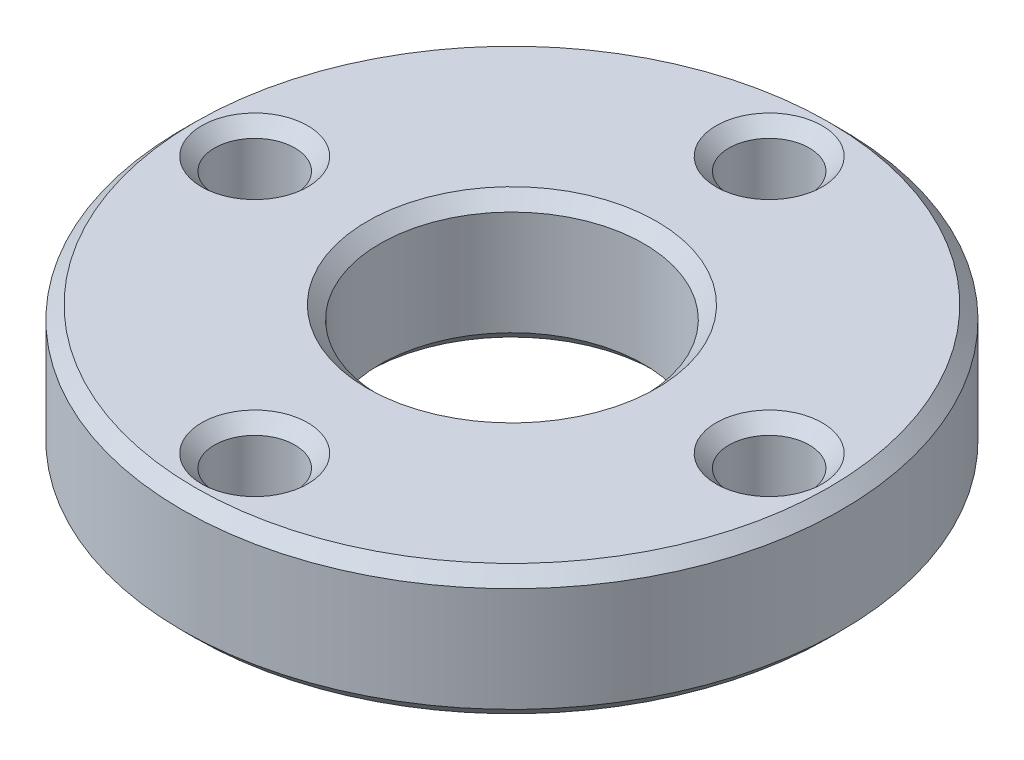
ISO-10303-21;
HEADER;
FILE_DESCRIPTION(('STEP AP214'),'2;1');
FILE_NAME('part.step','',(''),(''),'','','');
FILE_SCHEMA(('AUTOMOTIVE_DESIGN { 1 0 10303 214 1 1 1 1 }'));
ENDSEC;
DATA;
#1=APPLICATION_CONTEXT('core data for automotive mechanical design processes');
#2=APPLICATION_PROTOCOL_DEFINITION('international standard','automotive_design',2000,#1);
#3=PRODUCT_CONTEXT('',#1,'mechanical');
#4=PRODUCT('Part','Part','',(#3));
#5=PRODUCT_RELATED_PRODUCT_CATEGORY('part','',(#4));
#6=PRODUCT_DEFINITION_FORMATION('','',#4);
#7=PRODUCT_DEFINITION_CONTEXT('part definition',#1,'design');
#8=PRODUCT_DEFINITION('design','',#6,#7);
#9=PRODUCT_DEFINITION_SHAPE('','',#8);
#10=(LENGTH_UNIT() NAMED_UNIT(*) SI_UNIT(.MILLI.,.METRE.));
#11=(NAMED_UNIT(*) PLANE_ANGLE_UNIT() SI_UNIT($,.RADIAN.));
#12=(NAMED_UNIT(*) SI_UNIT($,.STERADIAN.) SOLID_ANGLE_UNIT());
#13=UNCERTAINTY_MEASURE_WITH_UNIT(LENGTH_MEASURE(1.E-05),#10,'distance_accuracy_value','');
#14=(GEOMETRIC_REPRESENTATION_CONTEXT(3) GLOBAL_UNCERTAINTY_ASSIGNED_CONTEXT((#13)) GLOBAL_UNIT_ASSIGNED_CONTEXT((#10,
#11,#12)) REPRESENTATION_CONTEXT('',''));
#15=CARTESIAN_POINT('',(0.,0.,0.));
#16=DIRECTION('',(0.,0.,1.));
#17=DIRECTION('',(1.,0.,0.));
#18=AXIS2_PLACEMENT_3D('',#15,#16,#17);
#19=CARTESIAN_POINT('',(0.,-4.05,0.));
#20=DIRECTION('',(0.,1.,0.));
#21=DIRECTION('',(0.,0.,1.));
#22=AXIS2_PLACEMENT_3D('',#19,#20,#21);
#23=CYLINDRICAL_SURFACE('',#22,10.25);
#24=CARTESIAN_POINT('',(0.,-3.65,0.));
#25=DIRECTION('',(0.,1.,0.));
#26=DIRECTION('',(0.,0.,1.));
#27=AXIS2_PLACEMENT_3D('',#24,#25,#26);
#28=CIRCLE('',#27,10.25);
#29=CARTESIAN_POINT('',(0.,-3.65,10.25));
#30=VERTEX_POINT('',#29);
#31=EDGE_CURVE('E10',#30,#30,#28,.T.);
#32=ORIENTED_EDGE('',*,*,#31,.T.);
#33=EDGE_LOOP('',(#32));
#34=FACE_BOUND('',#33,.T.);
#35=CARTESIAN_POINT('',(0.,-0.400000000000006,0.));
#36=DIRECTION('',(0.,1.,0.));
#37=DIRECTION('',(0.,0.,1.));
#38=AXIS2_PLACEMENT_3D('',#35,#36,#37);
#39=CIRCLE('',#38,10.25);
#40=CARTESIAN_POINT('',(0.,-0.400000000000006,10.25));
#41=VERTEX_POINT('',#40);
#42=EDGE_CURVE('E52',#41,#41,#39,.F.);
#43=ORIENTED_EDGE('',*,*,#42,.T.);
#44=EDGE_LOOP('',(#43));
#45=FACE_BOUND('',#44,.T.);
#46=ADVANCED_FACE('F44',(#34,#45),#23,.T.);
#47=CARTESIAN_POINT('',(0.,-4.05,0.));
#48=DIRECTION('',(0.,1.,0.));
#49=DIRECTION('',(0.,0.,1.));
#50=AXIS2_PLACEMENT_3D('',#47,#48,#49);
#51=PLANE('',#50);
#52=CARTESIAN_POINT('',(0.,-4.05,8.));
#53=DIRECTION('',(0.,1.,0.));
#54=DIRECTION('',(0.,0.,1.));
#55=AXIS2_PLACEMENT_3D('',#52,#53,#54);
#56=CIRCLE('',#55,1.65);
#57=CARTESIAN_POINT('',(0.,-4.05,9.65));
#58=VERTEX_POINT('',#57);
#59=EDGE_CURVE('E107',#58,#58,#56,.T.);
#60=ORIENTED_EDGE('',*,*,#59,.T.);
#61=EDGE_LOOP('',(#60));
#62=FACE_BOUND('',#61,.T.);
#63=CARTESIAN_POINT('',(8.,-4.05,0.));
#64=DIRECTION('',(0.,1.,0.));
#65=DIRECTION('',(0.,0.,1.));
#66=AXIS2_PLACEMENT_3D('',#63,#64,#65);
#67=CIRCLE('',#66,1.65);
#68=CARTESIAN_POINT('',(8.,-4.05,1.64999999999991));
#69=VERTEX_POINT('',#68);
#70=EDGE_CURVE('E110',#69,#69,#67,.T.);
#71=ORIENTED_EDGE('',*,*,#70,.T.);
#72=EDGE_LOOP('',(#71));
#73=FACE_BOUND('',#72,.T.);
#74=CARTESIAN_POINT('',(0.,-4.05,-8.));
#75=DIRECTION('',(0.,1.,0.));
#76=DIRECTION('',(0.,0.,1.));
#77=AXIS2_PLACEMENT_3D('',#74,#75,#76);
#78=CIRCLE('',#77,1.65);
#79=CARTESIAN_POINT('',(0.,-4.05,-6.35));
#80=VERTEX_POINT('',#79);
#81=EDGE_CURVE('E113',#80,#80,#78,.T.);
#82=ORIENTED_EDGE('',*,*,#81,.T.);
#83=EDGE_LOOP('',(#82));
#84=FACE_BOUND('',#83,.T.);
#85=CARTESIAN_POINT('',(-8.,-4.05,0.));
#86=DIRECTION('',(0.,1.,0.));
#87=DIRECTION('',(0.,0.,1.));
#88=AXIS2_PLACEMENT_3D('',#85,#86,#87);
#89=CIRCLE('',#88,1.65);
#90=CARTESIAN_POINT('',(-8.,-4.05,1.65000000000002));
#91=VERTEX_POINT('',#90);
#92=EDGE_CURVE('E116',#91,#91,#89,.T.);
#93=ORIENTED_EDGE('',*,*,#92,.T.);
#94=EDGE_LOOP('',(#93));
#95=FACE_BOUND('',#94,.T.);
#96=CARTESIAN_POINT('',(0.,-4.05,0.));
#97=DIRECTION('',(0.,1.,0.));
#98=DIRECTION('',(0.,0.,1.));
#99=AXIS2_PLACEMENT_3D('',#96,#97,#98);
#100=CIRCLE('',#99,4.49999999999999);
#101=CARTESIAN_POINT('',(0.,-4.05,4.49999999999999));
#102=VERTEX_POINT('',#101);
#103=EDGE_CURVE('E119',#102,#102,#100,.T.);
#104=ORIENTED_EDGE('',*,*,#103,.T.);
#105=EDGE_LOOP('',(#104));
#106=FACE_BOUND('',#105,.T.);
#107=CARTESIAN_POINT('',(0.,-4.05,0.));
#108=DIRECTION('',(0.,1.,0.));
#109=DIRECTION('',(0.,0.,1.));
#110=AXIS2_PLACEMENT_3D('',#107,#108,#109);
#111=CIRCLE('',#110,9.85);
#112=CARTESIAN_POINT('',(0.,-4.05,9.85));
#113=VERTEX_POINT('',#112);
#114=EDGE_CURVE('E122',#113,#113,#111,.F.);
#115=ORIENTED_EDGE('',*,*,#114,.T.);
#116=EDGE_LOOP('',(#115));
#117=FACE_BOUND('',#116,.T.);
#118=ADVANCED_FACE('F126',(#62,#73,#84,#95,#106,#117),#51,.F.);
#119=CARTESIAN_POINT('',(0.,0.,0.));
#120=DIRECTION('',(0.,1.,0.));
#121=DIRECTION('',(0.,0.,1.));
#122=AXIS2_PLACEMENT_3D('',#119,#120,#121);
#123=PLANE('',#122);
#124=CARTESIAN_POINT('',(8.,0.,0.));
#125=DIRECTION('',(0.,1.,0.));
#126=DIRECTION('',(0.,0.,1.));
#127=AXIS2_PLACEMENT_3D('',#124,#125,#126);
#128=CIRCLE('',#127,1.65000000000001);
#129=CARTESIAN_POINT('',(8.,0.,1.64999999999992));
#130=VERTEX_POINT('',#129);
#131=EDGE_CURVE('E56',#130,#130,#128,.F.);
#132=ORIENTED_EDGE('',*,*,#131,.T.);
#133=EDGE_LOOP('',(#132));
#134=FACE_BOUND('',#133,.T.);
#135=CARTESIAN_POINT('',(0.,0.,8.));
#136=DIRECTION('',(0.,1.,0.));
#137=DIRECTION('',(0.,0.,1.));
#138=AXIS2_PLACEMENT_3D('',#135,#136,#137);
#139=CIRCLE('',#138,1.65000000000001);
#140=CARTESIAN_POINT('',(0.,0.,9.65000000000001));
#141=VERTEX_POINT('',#140);
#142=EDGE_CURVE('E60',#141,#141,#139,.F.);
#143=ORIENTED_EDGE('',*,*,#142,.T.);
#144=EDGE_LOOP('',(#143));
#145=FACE_BOUND('',#144,.T.);
#146=CARTESIAN_POINT('',(-8.,0.,0.));
#147=DIRECTION('',(0.,1.,0.));
#148=DIRECTION('',(0.,0.,1.));
#149=AXIS2_PLACEMENT_3D('',#146,#147,#148);
#150=CIRCLE('',#149,1.65000000000001);
#151=CARTESIAN_POINT('',(-8.,0.,1.65000000000003));
#152=VERTEX_POINT('',#151);
#153=EDGE_CURVE('E65',#152,#152,#150,.F.);
#154=ORIENTED_EDGE('',*,*,#153,.T.);
#155=EDGE_LOOP('',(#154));
#156=FACE_BOUND('',#155,.T.);
#157=CARTESIAN_POINT('',(0.,0.,0.));
#158=DIRECTION('',(0.,1.,0.));
#159=DIRECTION('',(0.,0.,1.));
#160=AXIS2_PLACEMENT_3D('',#157,#158,#159);
#161=CIRCLE('',#160,9.84999999999999);
#162=CARTESIAN_POINT('',(0.,0.,9.84999999999999));
#163=VERTEX_POINT('',#162);
#164=EDGE_CURVE('E68',#163,#163,#161,.T.);
#165=ORIENTED_EDGE('',*,*,#164,.T.);
#166=EDGE_LOOP('',(#165));
#167=FACE_BOUND('',#166,.T.);
#168=CARTESIAN_POINT('',(0.,0.,-8.));
#169=DIRECTION('',(0.,1.,0.));
#170=DIRECTION('',(0.,0.,1.));
#171=AXIS2_PLACEMENT_3D('',#168,#169,#170);
#172=CIRCLE('',#171,1.65000000000001);
#173=CARTESIAN_POINT('',(0.,0.,-6.34999999999999));
#174=VERTEX_POINT('',#173);
#175=EDGE_CURVE('E71',#174,#174,#172,.F.);
#176=ORIENTED_EDGE('',*,*,#175,.T.);
#177=EDGE_LOOP('',(#176));
#178=FACE_BOUND('',#177,.T.);
#179=CARTESIAN_POINT('',(0.,0.,0.));
#180=DIRECTION('',(0.,1.,0.));
#181=DIRECTION('',(0.,0.,1.));
#182=AXIS2_PLACEMENT_3D('',#179,#180,#181);
#183=CIRCLE('',#182,4.5);
#184=CARTESIAN_POINT('',(0.,0.,4.5));
#185=VERTEX_POINT('',#184);
#186=EDGE_CURVE('E74',#185,#185,#183,.F.);
#187=ORIENTED_EDGE('',*,*,#186,.T.);
#188=EDGE_LOOP('',(#187));
#189=FACE_BOUND('',#188,.T.);
#190=ADVANCED_FACE('F150',(#134,#145,#156,#167,#178,#189),#123,.T.);
#191=CARTESIAN_POINT('',(0.,-4.05,0.));
#192=DIRECTION('',(0.,1.,0.));
#193=DIRECTION('',(0.,0.,1.));
#194=AXIS2_PLACEMENT_3D('',#191,#192,#193);
#195=CYLINDRICAL_SURFACE('',#194,4.1);
#196=CARTESIAN_POINT('',(0.,-3.65,0.));
#197=DIRECTION('',(0.,1.,0.));
#198=DIRECTION('',(0.,0.,1.));
#199=AXIS2_PLACEMENT_3D('',#196,#197,#198);
#200=CIRCLE('',#199,4.1);
#201=CARTESIAN_POINT('',(0.,-3.65,4.1));
#202=VERTEX_POINT('',#201);
#203=EDGE_CURVE('E77',#202,#202,#200,.F.);
#204=ORIENTED_EDGE('',*,*,#203,.T.);
#205=EDGE_LOOP('',(#204));
#206=FACE_BOUND('',#205,.T.);
#207=CARTESIAN_POINT('',(0.,-0.400000000000001,0.));
#208=DIRECTION('',(0.,1.,0.));
#209=DIRECTION('',(0.,0.,1.));
#210=AXIS2_PLACEMENT_3D('',#207,#208,#209);
#211=CIRCLE('',#210,4.1);
#212=CARTESIAN_POINT('',(0.,-0.400000000000001,4.1));
#213=VERTEX_POINT('',#212);
#214=EDGE_CURVE('E80',#213,#213,#211,.T.);
#215=ORIENTED_EDGE('',*,*,#214,.T.);
#216=EDGE_LOOP('',(#215));
#217=FACE_BOUND('',#216,.T.);
#218=ADVANCED_FACE('F229',(#206,#217),#195,.F.);
#219=CARTESIAN_POINT('',(0.,-4.05,-8.));
#220=DIRECTION('',(0.,1.,0.));
#221=DIRECTION('',(0.,0.,1.));
#222=AXIS2_PLACEMENT_3D('',#219,#220,#221);
#223=CYLINDRICAL_SURFACE('',#222,1.25);
#224=CARTESIAN_POINT('',(0.,-3.65,-8.));
#225=DIRECTION('',(0.,1.,0.));
#226=DIRECTION('',(0.,0.,1.));
#227=AXIS2_PLACEMENT_3D('',#224,#225,#226);
#228=CIRCLE('',#227,1.25);
#229=CARTESIAN_POINT('',(0.,-3.65,-6.75));
#230=VERTEX_POINT('',#229);
#231=EDGE_CURVE('E89',#230,#230,#228,.F.);
#232=ORIENTED_EDGE('',*,*,#231,.T.);
#233=EDGE_LOOP('',(#232));
#234=FACE_BOUND('',#233,.T.);
#235=CARTESIAN_POINT('',(0.,-0.400000000000006,-8.));
#236=DIRECTION('',(0.,1.,0.));
#237=DIRECTION('',(0.,0.,1.));
#238=AXIS2_PLACEMENT_3D('',#235,#236,#237);
#239=CIRCLE('',#238,1.25);
#240=CARTESIAN_POINT('',(0.,-0.400000000000006,-6.75));
#241=VERTEX_POINT('',#240);
#242=EDGE_CURVE('E92',#241,#241,#239,.T.);
#243=ORIENTED_EDGE('',*,*,#242,.T.);
#244=EDGE_LOOP('',(#243));
#245=FACE_BOUND('',#244,.T.);
#246=ADVANCED_FACE('F226',(#234,#245),#223,.F.);
#247=CARTESIAN_POINT('',(8.,-4.05,0.));
#248=DIRECTION('',(0.,1.,0.));
#249=DIRECTION('',(0.,0.,1.));
#250=AXIS2_PLACEMENT_3D('',#247,#248,#249);
#251=CYLINDRICAL_SURFACE('',#250,1.25);
#252=CARTESIAN_POINT('',(8.,-3.65,0.));
#253=DIRECTION('',(0.,1.,0.));
#254=DIRECTION('',(0.,0.,1.));
#255=AXIS2_PLACEMENT_3D('',#252,#253,#254);
#256=CIRCLE('',#255,1.25);
#257=CARTESIAN_POINT('',(8.,-3.65,1.24999999999992));
#258=VERTEX_POINT('',#257);
#259=EDGE_CURVE('E95',#258,#258,#256,.F.);
#260=ORIENTED_EDGE('',*,*,#259,.T.);
#261=EDGE_LOOP('',(#260));
#262=FACE_BOUND('',#261,.T.);
#263=CARTESIAN_POINT('',(8.,-0.400000000000006,0.));
#264=DIRECTION('',(0.,1.,0.));
#265=DIRECTION('',(0.,0.,1.));
#266=AXIS2_PLACEMENT_3D('',#263,#264,#265);
#267=CIRCLE('',#266,1.25);
#268=CARTESIAN_POINT('',(8.,-0.400000000000006,1.24999999999992));
#269=VERTEX_POINT('',#268);
#270=EDGE_CURVE('E98',#269,#269,#267,.T.);
#271=ORIENTED_EDGE('',*,*,#270,.T.);
#272=EDGE_LOOP('',(#271));
#273=FACE_BOUND('',#272,.T.);
#274=ADVANCED_FACE('F228',(#262,#273),#251,.F.);
#275=CARTESIAN_POINT('',(0.,-4.05,8.));
#276=DIRECTION('',(0.,1.,0.));
#277=DIRECTION('',(0.,0.,1.));
#278=AXIS2_PLACEMENT_3D('',#275,#276,#277);
#279=CYLINDRICAL_SURFACE('',#278,1.25);
#280=CARTESIAN_POINT('',(0.,-3.65,8.));
#281=DIRECTION('',(0.,1.,0.));
#282=DIRECTION('',(0.,0.,1.));
#283=AXIS2_PLACEMENT_3D('',#280,#281,#282);
#284=CIRCLE('',#283,1.25);
#285=CARTESIAN_POINT('',(0.,-3.65,9.25));
#286=VERTEX_POINT('',#285);
#287=EDGE_CURVE('E101',#286,#286,#284,.F.);
#288=ORIENTED_EDGE('',*,*,#287,.T.);
#289=EDGE_LOOP('',(#288));
#290=FACE_BOUND('',#289,.T.);
#291=CARTESIAN_POINT('',(0.,-0.400000000000006,8.));
#292=DIRECTION('',(0.,1.,0.));
#293=DIRECTION('',(0.,0.,1.));
#294=AXIS2_PLACEMENT_3D('',#291,#292,#293);
#295=CIRCLE('',#294,1.25);
#296=CARTESIAN_POINT('',(0.,-0.400000000000006,9.25));
#297=VERTEX_POINT('',#296);
#298=EDGE_CURVE('E104',#297,#297,#295,.T.);
#299=ORIENTED_EDGE('',*,*,#298,.T.);
#300=EDGE_LOOP('',(#299));
#301=FACE_BOUND('',#300,.T.);
#302=ADVANCED_FACE('F236',(#290,#301),#279,.F.);
#303=CARTESIAN_POINT('',(-8.,-4.05,0.));
#304=DIRECTION('',(0.,1.,0.));
#305=DIRECTION('',(0.,0.,1.));
#306=AXIS2_PLACEMENT_3D('',#303,#304,#305);
#307=CYLINDRICAL_SURFACE('',#306,1.25);
#308=CARTESIAN_POINT('',(-8.,-3.65,0.));
#309=DIRECTION('',(0.,1.,0.));
#310=DIRECTION('',(0.,0.,1.));
#311=AXIS2_PLACEMENT_3D('',#308,#309,#310);
#312=CIRCLE('',#311,1.25);
#313=CARTESIAN_POINT('',(-8.,-3.65,1.25000000000003));
#314=VERTEX_POINT('',#313);
#315=EDGE_CURVE('E83',#314,#314,#312,.F.);
#316=ORIENTED_EDGE('',*,*,#315,.T.);
#317=EDGE_LOOP('',(#316));
#318=FACE_BOUND('',#317,.T.);
#319=CARTESIAN_POINT('',(-8.,-0.400000000000006,0.));
#320=DIRECTION('',(0.,1.,0.));
#321=DIRECTION('',(0.,0.,1.));
#322=AXIS2_PLACEMENT_3D('',#319,#320,#321);
#323=CIRCLE('',#322,1.25);
#324=CARTESIAN_POINT('',(-8.,-0.400000000000006,1.25000000000003));
#325=VERTEX_POINT('',#324);
#326=EDGE_CURVE('E86',#325,#325,#323,.T.);
#327=ORIENTED_EDGE('',*,*,#326,.T.);
#328=EDGE_LOOP('',(#327));
#329=FACE_BOUND('',#328,.T.);
#330=ADVANCED_FACE('F163',(#318,#329),#307,.F.);
#331=CARTESIAN_POINT('',(0.,-4.05,8.));
#332=DIRECTION('',(0.,-1.,0.));
#333=DIRECTION('',(0.,0.,-1.));
#334=AXIS2_PLACEMENT_3D('',#331,#332,#333);
#335=CONICAL_SURFACE('',#334,1.65,0.785398163397444);
#336=ORIENTED_EDGE('',*,*,#287,.F.);
#337=EDGE_LOOP('',(#336));
#338=FACE_BOUND('',#337,.T.);
#339=ORIENTED_EDGE('',*,*,#59,.F.);
#340=EDGE_LOOP('',(#339));
#341=FACE_BOUND('',#340,.T.);
#342=ADVANCED_FACE('F156',(#338,#341),#335,.F.);
#343=CARTESIAN_POINT('',(8.,-4.05,0.));
#344=DIRECTION('',(0.,-1.,0.));
#345=DIRECTION('',(0.,0.,-1.));
#346=AXIS2_PLACEMENT_3D('',#343,#344,#345);
#347=CONICAL_SURFACE('',#346,1.65,0.785398163397444);
#348=ORIENTED_EDGE('',*,*,#259,.F.);
#349=EDGE_LOOP('',(#348));
#350=FACE_BOUND('',#349,.T.);
#351=ORIENTED_EDGE('',*,*,#70,.F.);
#352=EDGE_LOOP('',(#351));
#353=FACE_BOUND('',#352,.T.);
#354=ADVANCED_FACE('F162',(#350,#353),#347,.F.);
#355=CARTESIAN_POINT('',(0.,-4.05,-8.));
#356=DIRECTION('',(0.,-1.,0.));
#357=DIRECTION('',(0.,0.,-1.));
#358=AXIS2_PLACEMENT_3D('',#355,#356,#357);
#359=CONICAL_SURFACE('',#358,1.65,0.785398163397444);
#360=ORIENTED_EDGE('',*,*,#231,.F.);
#361=EDGE_LOOP('',(#360));
#362=FACE_BOUND('',#361,.T.);
#363=ORIENTED_EDGE('',*,*,#81,.F.);
#364=EDGE_LOOP('',(#363));
#365=FACE_BOUND('',#364,.T.);
#366=ADVANCED_FACE('F170',(#362,#365),#359,.F.);
#367=CARTESIAN_POINT('',(-8.,-4.05,0.));
#368=DIRECTION('',(0.,-1.,0.));
#369=DIRECTION('',(0.,0.,-1.));
#370=AXIS2_PLACEMENT_3D('',#367,#368,#369);
#371=CONICAL_SURFACE('',#370,1.65,0.785398163397444);
#372=ORIENTED_EDGE('',*,*,#315,.F.);
#373=EDGE_LOOP('',(#372));
#374=FACE_BOUND('',#373,.T.);
#375=ORIENTED_EDGE('',*,*,#92,.F.);
#376=EDGE_LOOP('',(#375));
#377=FACE_BOUND('',#376,.T.);
#378=ADVANCED_FACE('F177',(#374,#377),#371,.F.);
#379=CARTESIAN_POINT('',(0.,-4.05,0.));
#380=DIRECTION('',(0.,-1.,0.));
#381=DIRECTION('',(0.,0.,-1.));
#382=AXIS2_PLACEMENT_3D('',#379,#380,#381);
#383=CONICAL_SURFACE('',#382,4.49999999999999,0.785398163397441);
#384=ORIENTED_EDGE('',*,*,#203,.F.);
#385=EDGE_LOOP('',(#384));
#386=FACE_BOUND('',#385,.T.);
#387=ORIENTED_EDGE('',*,*,#103,.F.);
#388=EDGE_LOOP('',(#387));
#389=FACE_BOUND('',#388,.T.);
#390=ADVANCED_FACE('F184',(#386,#389),#383,.F.);
#391=CARTESIAN_POINT('',(8.,-0.400000000000006,0.));
#392=DIRECTION('',(0.,1.,0.));
#393=DIRECTION('',(0.,0.,1.));
#394=AXIS2_PLACEMENT_3D('',#391,#392,#393);
#395=CONICAL_SURFACE('',#394,1.25,0.785398163397448);
#396=ORIENTED_EDGE('',*,*,#131,.F.);
#397=EDGE_LOOP('',(#396));
#398=FACE_BOUND('',#397,.T.);
#399=ORIENTED_EDGE('',*,*,#270,.F.);
#400=EDGE_LOOP('',(#399));
#401=FACE_BOUND('',#400,.T.);
#402=ADVANCED_FACE('F141',(#398,#401),#395,.F.);
#403=CARTESIAN_POINT('',(0.,-0.400000000000006,8.));
#404=DIRECTION('',(0.,1.,0.));
#405=DIRECTION('',(0.,0.,1.));
#406=AXIS2_PLACEMENT_3D('',#403,#404,#405);
#407=CONICAL_SURFACE('',#406,1.25,0.785398163397448);
#408=ORIENTED_EDGE('',*,*,#142,.F.);
#409=EDGE_LOOP('',(#408));
#410=FACE_BOUND('',#409,.T.);
#411=ORIENTED_EDGE('',*,*,#298,.F.);
#412=EDGE_LOOP('',(#411));
#413=FACE_BOUND('',#412,.T.);
#414=ADVANCED_FACE('F132',(#410,#413),#407,.F.);
#415=CARTESIAN_POINT('',(0.,-3.65,0.));
#416=DIRECTION('',(0.,1.,0.));
#417=DIRECTION('',(0.,0.,1.));
#418=AXIS2_PLACEMENT_3D('',#415,#416,#417);
#419=CONICAL_SURFACE('',#418,10.25,0.78539816339745);
#420=ORIENTED_EDGE('',*,*,#114,.F.);
#421=EDGE_LOOP('',(#420));
#422=FACE_BOUND('',#421,.T.);
#423=ORIENTED_EDGE('',*,*,#31,.F.);
#424=EDGE_LOOP('',(#423));
#425=FACE_BOUND('',#424,.T.);
#426=ADVANCED_FACE('F128',(#422,#425),#419,.T.);
#427=CARTESIAN_POINT('',(-8.,-0.400000000000006,0.));
#428=DIRECTION('',(0.,1.,0.));
#429=DIRECTION('',(0.,0.,1.));
#430=AXIS2_PLACEMENT_3D('',#427,#428,#429);
#431=CONICAL_SURFACE('',#430,1.25,0.785398163397448);
#432=ORIENTED_EDGE('',*,*,#153,.F.);
#433=EDGE_LOOP('',(#432));
#434=FACE_BOUND('',#433,.T.);
#435=ORIENTED_EDGE('',*,*,#326,.F.);
#436=EDGE_LOOP('',(#435));
#437=FACE_BOUND('',#436,.T.);
#438=ADVANCED_FACE('F131',(#434,#437),#431,.F.);
#439=CARTESIAN_POINT('',(0.,0.,0.));
#440=DIRECTION('',(0.,-1.,0.));
#441=DIRECTION('',(0.,0.,-1.));
#442=AXIS2_PLACEMENT_3D('',#439,#440,#441);
#443=CONICAL_SURFACE('',#442,9.84999999999999,0.785398163397448);
#444=ORIENTED_EDGE('',*,*,#42,.F.);
#445=EDGE_LOOP('',(#444));
#446=FACE_BOUND('',#445,.T.);
#447=ORIENTED_EDGE('',*,*,#164,.F.);
#448=EDGE_LOOP('',(#447));
#449=FACE_BOUND('',#448,.T.);
#450=ADVANCED_FACE('F138',(#446,#449),#443,.T.);
#451=CARTESIAN_POINT('',(0.,-0.400000000000006,-8.));
#452=DIRECTION('',(0.,1.,0.));
#453=DIRECTION('',(0.,0.,1.));
#454=AXIS2_PLACEMENT_3D('',#451,#452,#453);
#455=CONICAL_SURFACE('',#454,1.25,0.785398163397448);
#456=ORIENTED_EDGE('',*,*,#175,.F.);
#457=EDGE_LOOP('',(#456));
#458=FACE_BOUND('',#457,.T.);
#459=ORIENTED_EDGE('',*,*,#242,.F.);
#460=EDGE_LOOP('',(#459));
#461=FACE_BOUND('',#460,.T.);
#462=ADVANCED_FACE('F211',(#458,#461),#455,.F.);
#463=CARTESIAN_POINT('',(0.,-0.400000000000001,0.));
#464=DIRECTION('',(0.,1.,0.));
#465=DIRECTION('',(0.,0.,1.));
#466=AXIS2_PLACEMENT_3D('',#463,#464,#465);
#467=CONICAL_SURFACE('',#466,4.1,0.785398163397448);
#468=ORIENTED_EDGE('',*,*,#186,.F.);
#469=EDGE_LOOP('',(#468));
#470=FACE_BOUND('',#469,.T.);
#471=ORIENTED_EDGE('',*,*,#214,.F.);
#472=EDGE_LOOP('',(#471));
#473=FACE_BOUND('',#472,.T.);
#474=ADVANCED_FACE('F47',(#470,#473),#467,.F.);
#475=CLOSED_SHELL('',(#46,#118,#190,#218,#246,#274,#302,#330,#342,#354,#366,#378,#390,#402,#414,
#426,#438,#450,#462,#474));
#476=MANIFOLD_SOLID_BREP('B2',#475);
#477=ADVANCED_BREP_SHAPE_REPRESENTATION('',(#18,#476),#14);
#478=SHAPE_DEFINITION_REPRESENTATION(#9,#477);
ENDSEC;
END-ISO-10303-21;
